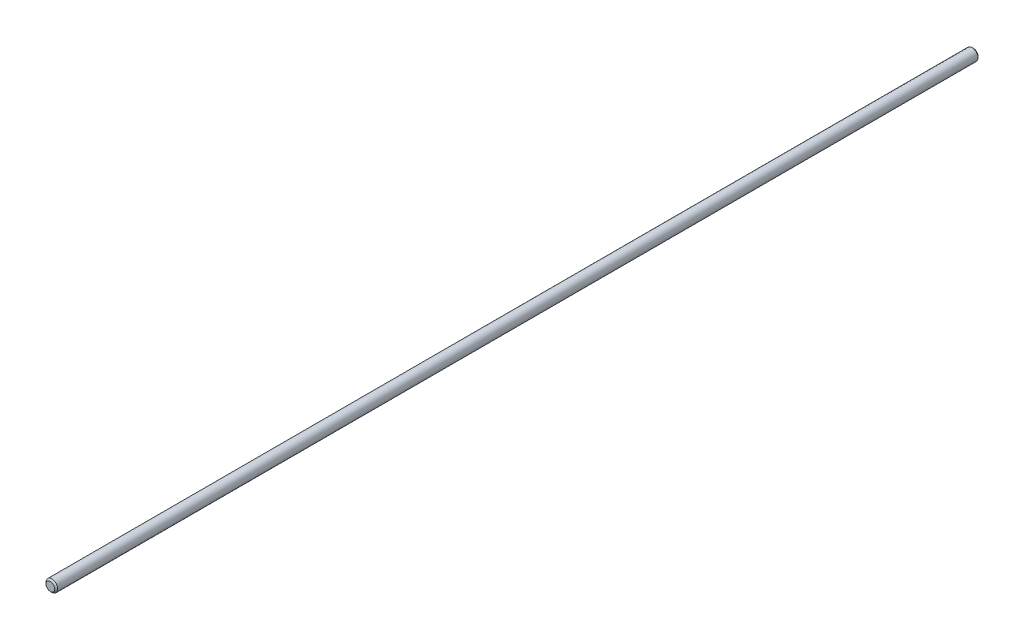
ISO-10303-21;
HEADER;
FILE_DESCRIPTION(('STEP AP214'),'2;1');
FILE_NAME('part.step','',(''),(''),'','','');
FILE_SCHEMA(('AUTOMOTIVE_DESIGN { 1 0 10303 214 1 1 1 1 }'));
ENDSEC;
DATA;
#1=APPLICATION_CONTEXT('core data for automotive mechanical design processes');
#2=APPLICATION_PROTOCOL_DEFINITION('international standard','automotive_design',2000,#1);
#3=PRODUCT_CONTEXT('',#1,'mechanical');
#4=PRODUCT('Part','Part','',(#3));
#5=PRODUCT_RELATED_PRODUCT_CATEGORY('part','',(#4));
#6=PRODUCT_DEFINITION_FORMATION('','',#4);
#7=PRODUCT_DEFINITION_CONTEXT('part definition',#1,'design');
#8=PRODUCT_DEFINITION('design','',#6,#7);
#9=PRODUCT_DEFINITION_SHAPE('','',#8);
#10=(LENGTH_UNIT() NAMED_UNIT(*) SI_UNIT(.MILLI.,.METRE.));
#11=(NAMED_UNIT(*) PLANE_ANGLE_UNIT() SI_UNIT($,.RADIAN.));
#12=(NAMED_UNIT(*) SI_UNIT($,.STERADIAN.) SOLID_ANGLE_UNIT());
#13=UNCERTAINTY_MEASURE_WITH_UNIT(LENGTH_MEASURE(1.E-05),#10,'distance_accuracy_value','');
#14=(GEOMETRIC_REPRESENTATION_CONTEXT(3) GLOBAL_UNCERTAINTY_ASSIGNED_CONTEXT((#13)) GLOBAL_UNIT_ASSIGNED_CONTEXT((#10,
#11,#12)) REPRESENTATION_CONTEXT('',''));
#15=CARTESIAN_POINT('',(0.,0.,0.));
#16=DIRECTION('',(0.,0.,1.));
#17=DIRECTION('',(1.,0.,0.));
#18=AXIS2_PLACEMENT_3D('',#15,#16,#17);
#19=CARTESIAN_POINT('',(0.,0.,630.));
#20=DIRECTION('',(0.,0.,-1.));
#21=DIRECTION('',(-1.,0.,0.));
#22=AXIS2_PLACEMENT_3D('',#19,#20,#21);
#23=CYLINDRICAL_SURFACE('',#22,4.);
#24=CARTESIAN_POINT('',(0.,0.,629.));
#25=DIRECTION('',(0.,0.,1.));
#26=DIRECTION('',(1.,0.,0.));
#27=AXIS2_PLACEMENT_3D('',#24,#25,#26);
#28=CIRCLE('',#27,4.);
#29=CARTESIAN_POINT('',(4.,0.,629.));
#30=VERTEX_POINT('',#29);
#31=EDGE_CURVE('E40',#30,#30,#28,.F.);
#32=ORIENTED_EDGE('',*,*,#31,.T.);
#33=EDGE_LOOP('',(#32));
#34=FACE_BOUND('',#33,.T.);
#35=CARTESIAN_POINT('',(0.,0.,0.999999999999779));
#36=DIRECTION('',(0.,0.,1.));
#37=DIRECTION('',(1.,0.,0.));
#38=AXIS2_PLACEMENT_3D('',#35,#36,#37);
#39=CIRCLE('',#38,4.);
#40=CARTESIAN_POINT('',(4.,0.,0.999999999999779));
#41=VERTEX_POINT('',#40);
#42=EDGE_CURVE('E44',#41,#41,#39,.T.);
#43=ORIENTED_EDGE('',*,*,#42,.T.);
#44=EDGE_LOOP('',(#43));
#45=FACE_BOUND('',#44,.T.);
#46=ADVANCED_FACE('F33',(#34,#45),#23,.T.);
#47=CARTESIAN_POINT('',(0.,0.,630.));
#48=DIRECTION('',(0.,0.,1.));
#49=DIRECTION('',(1.,0.,0.));
#50=AXIS2_PLACEMENT_3D('',#47,#48,#49);
#51=PLANE('',#50);
#52=CARTESIAN_POINT('',(0.,0.,630.));
#53=DIRECTION('',(0.,0.,1.));
#54=DIRECTION('',(1.,0.,0.));
#55=AXIS2_PLACEMENT_3D('',#52,#53,#54);
#56=CIRCLE('',#55,2.99999999999995);
#57=CARTESIAN_POINT('',(2.99999999999995,0.,630.));
#58=VERTEX_POINT('',#57);
#59=EDGE_CURVE('E48',#58,#58,#56,.T.);
#60=ORIENTED_EDGE('',*,*,#59,.T.);
#61=EDGE_LOOP('',(#60));
#62=FACE_BOUND('',#61,.T.);
#63=ADVANCED_FACE('F54',(#62),#51,.T.);
#64=CARTESIAN_POINT('',(0.,0.,0.));
#65=DIRECTION('',(0.,0.,1.));
#66=DIRECTION('',(1.,0.,0.));
#67=AXIS2_PLACEMENT_3D('',#64,#65,#66);
#68=PLANE('',#67);
#69=CARTESIAN_POINT('',(0.,0.,0.));
#70=DIRECTION('',(0.,0.,1.));
#71=DIRECTION('',(1.,0.,0.));
#72=AXIS2_PLACEMENT_3D('',#69,#70,#71);
#73=CIRCLE('',#72,3.00000000000017);
#74=CARTESIAN_POINT('',(3.00000000000017,0.,0.));
#75=VERTEX_POINT('',#74);
#76=EDGE_CURVE('E10',#75,#75,#73,.F.);
#77=ORIENTED_EDGE('',*,*,#76,.T.);
#78=EDGE_LOOP('',(#77));
#79=FACE_BOUND('',#78,.T.);
#80=ADVANCED_FACE('F58',(#79),#68,.F.);
#81=CARTESIAN_POINT('',(0.,0.,630.));
#82=DIRECTION('',(0.,0.,-1.));
#83=DIRECTION('',(-1.,0.,0.));
#84=AXIS2_PLACEMENT_3D('',#81,#82,#83);
#85=CONICAL_SURFACE('',#84,2.99999999999995,0.785398163397474);
#86=ORIENTED_EDGE('',*,*,#31,.F.);
#87=EDGE_LOOP('',(#86));
#88=FACE_BOUND('',#87,.T.);
#89=ORIENTED_EDGE('',*,*,#59,.F.);
#90=EDGE_LOOP('',(#89));
#91=FACE_BOUND('',#90,.T.);
#92=ADVANCED_FACE('F56',(#88,#91),#85,.T.);
#93=CARTESIAN_POINT('',(0.,0.,0.999999999999779));
#94=DIRECTION('',(0.,0.,1.));
#95=DIRECTION('',(1.,0.,0.));
#96=AXIS2_PLACEMENT_3D('',#93,#94,#95);
#97=CONICAL_SURFACE('',#96,4.,0.785398163397474);
#98=ORIENTED_EDGE('',*,*,#76,.F.);
#99=EDGE_LOOP('',(#98));
#100=FACE_BOUND('',#99,.T.);
#101=ORIENTED_EDGE('',*,*,#42,.F.);
#102=EDGE_LOOP('',(#101));
#103=FACE_BOUND('',#102,.T.);
#104=ADVANCED_FACE('F35',(#100,#103),#97,.T.);
#105=CLOSED_SHELL('',(#46,#63,#80,#92,#104));
#106=MANIFOLD_SOLID_BREP('B2',#105);
#107=ADVANCED_BREP_SHAPE_REPRESENTATION('',(#18,#106),#14);
#108=SHAPE_DEFINITION_REPRESENTATION(#9,#107);
ENDSEC;
END-ISO-10303-21;
